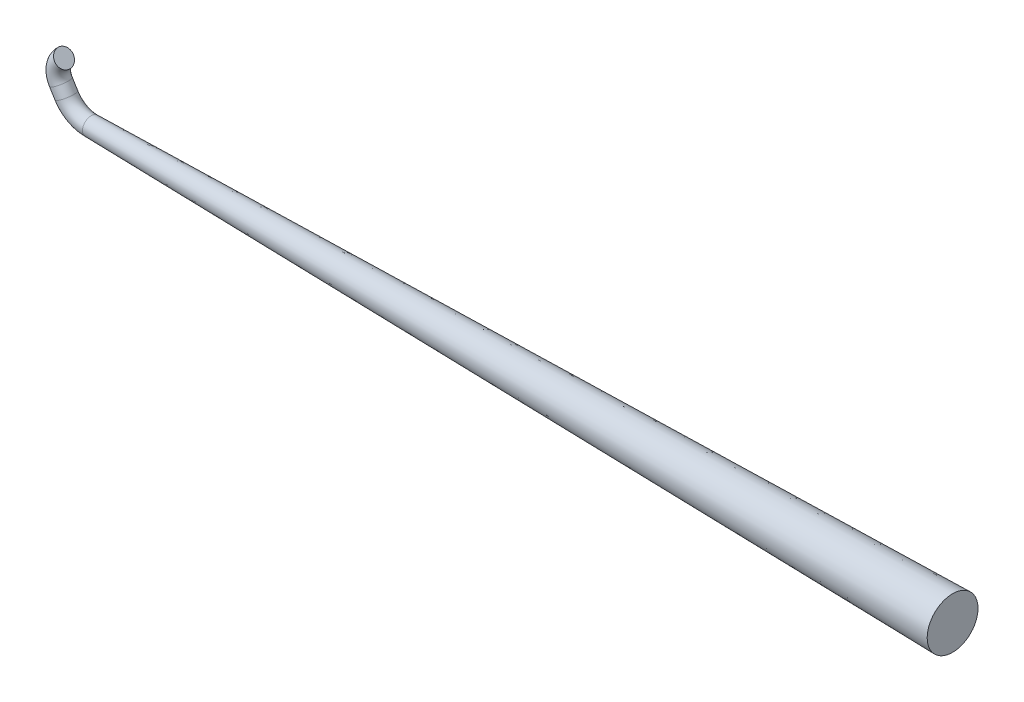
ISO-10303-21;
HEADER;
FILE_DESCRIPTION(('STEP AP214'),'2;1');
FILE_NAME('part.step','',(''),(''),'','','');
FILE_SCHEMA(('AUTOMOTIVE_DESIGN { 1 0 10303 214 1 1 1 1 }'));
ENDSEC;
DATA;
#1=APPLICATION_CONTEXT('core data for automotive mechanical design processes');
#2=APPLICATION_PROTOCOL_DEFINITION('international standard','automotive_design',2000,#1);
#3=PRODUCT_CONTEXT('',#1,'mechanical');
#4=PRODUCT('Part','Part','',(#3));
#5=PRODUCT_RELATED_PRODUCT_CATEGORY('part','',(#4));
#6=PRODUCT_DEFINITION_FORMATION('','',#4);
#7=PRODUCT_DEFINITION_CONTEXT('part definition',#1,'design');
#8=PRODUCT_DEFINITION('design','',#6,#7);
#9=PRODUCT_DEFINITION_SHAPE('','',#8);
#10=(LENGTH_UNIT() NAMED_UNIT(*) SI_UNIT(.MILLI.,.METRE.));
#11=(NAMED_UNIT(*) PLANE_ANGLE_UNIT() SI_UNIT($,.RADIAN.));
#12=(NAMED_UNIT(*) SI_UNIT($,.STERADIAN.) SOLID_ANGLE_UNIT());
#13=UNCERTAINTY_MEASURE_WITH_UNIT(LENGTH_MEASURE(1.E-05),#10,'distance_accuracy_value','');
#14=(GEOMETRIC_REPRESENTATION_CONTEXT(3) GLOBAL_UNCERTAINTY_ASSIGNED_CONTEXT((#13)) GLOBAL_UNIT_ASSIGNED_CONTEXT((#10,
#11,#12)) REPRESENTATION_CONTEXT('',''));
#15=CARTESIAN_POINT('',(0.,0.,0.));
#16=DIRECTION('',(0.,0.,1.));
#17=DIRECTION('',(1.,0.,0.));
#18=AXIS2_PLACEMENT_3D('',#15,#16,#17);
#19=CARTESIAN_POINT('',(-30.328870103393,23.595645629527,0.));
#20=DIRECTION('',(1.,0.,0.));
#21=DIRECTION('',(0.,1.,0.));
#22=AXIS2_PLACEMENT_3D('',#19,#20,#21);
#23=PLANE('',#22);
#24=CARTESIAN_POINT('',(-30.328870103393,22.3157282806285,0.));
#25=DIRECTION('',(1.,0.,0.));
#26=DIRECTION('',(0.,1.,0.));
#27=AXIS2_PLACEMENT_3D('',#24,#25,#26);
#28=CIRCLE('',#27,1.27991734889851);
#29=CARTESIAN_POINT('',(-30.328870103393,23.595645629527,0.));
#30=VERTEX_POINT('',#29);
#31=EDGE_CURVE('E10',#30,#30,#28,.T.);
#32=ORIENTED_EDGE('',*,*,#31,.T.);
#33=EDGE_LOOP('',(#32));
#34=FACE_BOUND('',#33,.T.);
#35=ADVANCED_FACE('F31',(#34),#23,.T.);
#36=CARTESIAN_POINT('',(-30.328870103393,22.3157282806285,0.));
#37=DIRECTION('',(1.,0.,0.));
#38=DIRECTION('',(0.,1.,0.));
#39=AXIS2_PLACEMENT_3D('',#36,#37,#38);
#40=CONICAL_SURFACE('',#39,1.27991734889851,0.0193976438137097);
#41=CARTESIAN_POINT('',(-73.7125347289975,22.3157282806285,0.));
#42=DIRECTION('',(-1.,0.,0.));
#43=DIRECTION('',(0.,-1.,0.));
#44=AXIS2_PLACEMENT_3D('',#41,#42,#43);
#45=CIRCLE('',#44,0.438270910804606);
#46=CARTESIAN_POINT('',(-73.7125347289975,21.8774573698239,0.));
#47=VERTEX_POINT('',#46);
#48=EDGE_CURVE('E50',#47,#47,#45,.T.);
#49=ORIENTED_EDGE('',*,*,#48,.F.);
#50=EDGE_LOOP('',(#49));
#51=FACE_BOUND('',#50,.T.);
#52=ORIENTED_EDGE('',*,*,#31,.F.);
#53=EDGE_LOOP('',(#52));
#54=FACE_BOUND('',#53,.T.);
#55=ADVANCED_FACE('F56',(#51,#54),#40,.T.);
#56=CARTESIAN_POINT('',(-74.4805660183856,23.9255081417727,0.));
#57=DIRECTION('',(0.,0.,-1.));
#58=DIRECTION('',(-1.,0.,0.));
#59=AXIS2_PLACEMENT_3D('',#56,#57,#58);
#60=TOROIDAL_SURFACE('',#59,0.889153712412004,0.438270910804606);
#61=CARTESIAN_POINT('',(-75.2363569355276,23.4571339176082,0.));
#62=DIRECTION('',(-0.526764065230105,0.85001154085239,0.));
#63=DIRECTION('',(-0.85001154085239,-0.526764065230105,0.));
#64=AXIS2_PLACEMENT_3D('',#61,#62,#63);
#65=CIRCLE('',#64,0.438270910804606);
#66=CARTESIAN_POINT('',(-75.6088922677314,23.2262685509606,0.));
#67=VERTEX_POINT('',#66);
#68=EDGE_CURVE('E41',#67,#67,#65,.T.);
#69=CARTESIAN_POINT('',(-75.0806149748462,24.5816602385816,0.));
#70=DIRECTION('',(0.737951253702677,0.674854019146843,0.));
#71=DIRECTION('',(-0.674854019146843,0.737951253702677,0.));
#72=AXIS2_PLACEMENT_3D('',#69,#70,#71);
#73=CIRCLE('',#72,0.438270910804606);
#74=CARTESIAN_POINT('',(-75.3763838604778,24.9050828066712,0.));
#75=VERTEX_POINT('',#74);
#76=EDGE_CURVE('E37',#75,#75,#73,.T.);
#77=CARTESIAN_POINT('',(-74.4805660183856,23.9255081417727,0.));
#78=DIRECTION('',(0.,0.,-1.));
#79=DIRECTION('',(-1.,0.,0.));
#80=AXIS2_PLACEMENT_3D('',#77,#78,#79);
#81=CIRCLE('',#80,1.32742462321661);
#82=EDGE_CURVE('',#67,#75,#81,.T.);
#83=ORIENTED_EDGE('',*,*,#68,.T.);
#84=ORIENTED_EDGE('',*,*,#76,.F.);
#85=ORIENTED_EDGE('',*,*,#82,.T.);
#86=ORIENTED_EDGE('',*,*,#82,.F.);
#87=EDGE_LOOP('',(#83,#85,#84,#86));
#88=FACE_BOUND('',#87,.T.);
#89=ADVANCED_FACE('F59',(#88),#60,.T.);
#90=CARTESIAN_POINT('',(-74.9591026801512,23.0097432689742,0.));
#91=DIRECTION('',(-0.526764065230112,0.850011540852385,0.));
#92=DIRECTION('',(-0.850011540852385,-0.526764065230112,0.));
#93=AXIS2_PLACEMENT_3D('',#90,#91,#92);
#94=CYLINDRICAL_SURFACE('',#93,0.438270910804606);
#95=CARTESIAN_POINT('',(-74.9591026801512,23.0097432689742,0.));
#96=DIRECTION('',(-0.526764065230105,0.85001154085239,0.));
#97=DIRECTION('',(-0.85001154085239,-0.526764065230105,0.));
#98=AXIS2_PLACEMENT_3D('',#95,#96,#97);
#99=CIRCLE('',#98,0.438270910804606);
#100=CARTESIAN_POINT('',(-75.331638012355,22.7788779023266,0.));
#101=VERTEX_POINT('',#100);
#102=EDGE_CURVE('E45',#101,#101,#99,.T.);
#103=ORIENTED_EDGE('',*,*,#102,.T.);
#104=EDGE_LOOP('',(#103));
#105=FACE_BOUND('',#104,.T.);
#106=ORIENTED_EDGE('',*,*,#68,.F.);
#107=EDGE_LOOP('',(#106));
#108=FACE_BOUND('',#107,.T.);
#109=ADVANCED_FACE('F64',(#105,#108),#94,.T.);
#110=CARTESIAN_POINT('',(-73.7125347289975,23.782258899617,0.));
#111=DIRECTION('',(0.,0.,1.));
#112=DIRECTION('',(1.,0.,0.));
#113=AXIS2_PLACEMENT_3D('',#110,#111,#112);
#114=TOROIDAL_SURFACE('',#113,1.4665306189885,0.438270910804606);
#115=CARTESIAN_POINT('',(-73.7125347289975,23.782258899617,0.));
#116=DIRECTION('',(0.,0.,1.));
#117=DIRECTION('',(1.,0.,0.));
#118=AXIS2_PLACEMENT_3D('',#115,#116,#117);
#119=CIRCLE('',#118,1.90480152979311);
#120=EDGE_CURVE('',#101,#47,#119,.T.);
#121=ORIENTED_EDGE('',*,*,#102,.F.);
#122=ORIENTED_EDGE('',*,*,#48,.T.);
#123=ORIENTED_EDGE('',*,*,#120,.T.);
#124=ORIENTED_EDGE('',*,*,#120,.F.);
#125=EDGE_LOOP('',(#121,#123,#122,#124));
#126=FACE_BOUND('',#125,.T.);
#127=ADVANCED_FACE('F54',(#126),#114,.T.);
#128=CARTESIAN_POINT('',(-75.0806149748462,24.5816602385816,0.));
#129=DIRECTION('',(0.737951253702677,0.674854019146843,0.));
#130=DIRECTION('',(-0.674854019146843,0.737951253702677,0.));
#131=AXIS2_PLACEMENT_3D('',#128,#129,#130);
#132=PLANE('',#131);
#133=ORIENTED_EDGE('',*,*,#76,.T.);
#134=EDGE_LOOP('',(#133));
#135=FACE_BOUND('',#134,.T.);
#136=ADVANCED_FACE('F73',(#135),#132,.T.);
#137=CLOSED_SHELL('',(#35,#55,#89,#109,#127,#136));
#138=MANIFOLD_SOLID_BREP('B2',#137);
#139=ADVANCED_BREP_SHAPE_REPRESENTATION('',(#18,#138),#14);
#140=SHAPE_DEFINITION_REPRESENTATION(#9,#139);
ENDSEC;
END-ISO-10303-21;
